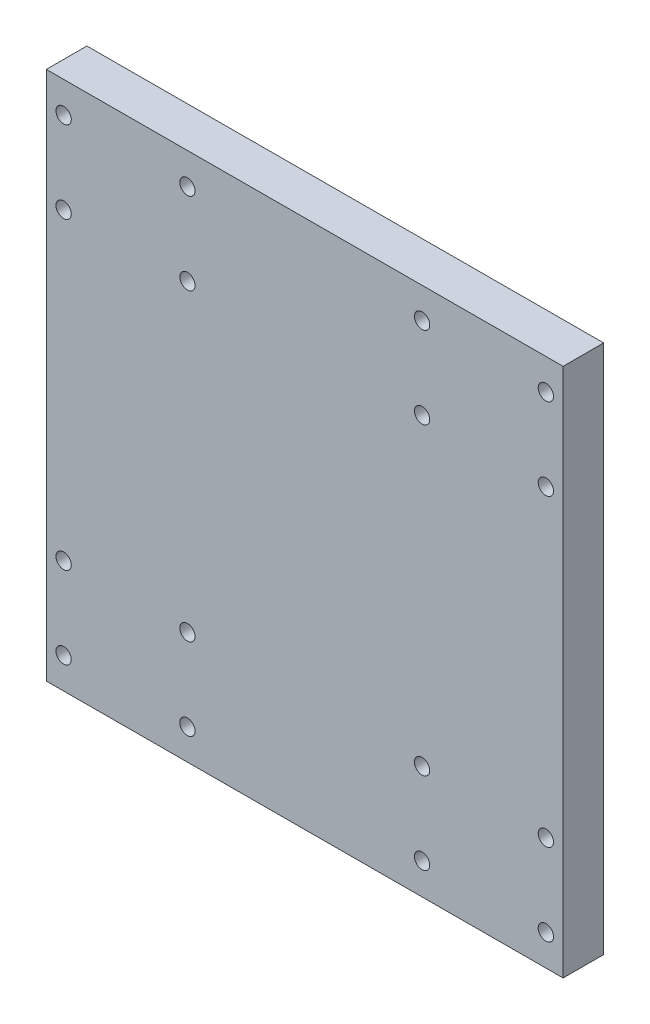
ISO-10303-21;
HEADER;
FILE_DESCRIPTION(('STEP AP214'),'2;1');
FILE_NAME('part.step','',(''),(''),'','','');
FILE_SCHEMA(('AUTOMOTIVE_DESIGN { 1 0 10303 214 1 1 1 1 }'));
ENDSEC;
DATA;
#1=APPLICATION_CONTEXT('core data for automotive mechanical design processes');
#2=APPLICATION_PROTOCOL_DEFINITION('international standard','automotive_design',2000,#1);
#3=PRODUCT_CONTEXT('',#1,'mechanical');
#4=PRODUCT('Part','Part','',(#3));
#5=PRODUCT_RELATED_PRODUCT_CATEGORY('part','',(#4));
#6=PRODUCT_DEFINITION_FORMATION('','',#4);
#7=PRODUCT_DEFINITION_CONTEXT('part definition',#1,'design');
#8=PRODUCT_DEFINITION('design','',#6,#7);
#9=PRODUCT_DEFINITION_SHAPE('','',#8);
#10=(LENGTH_UNIT() NAMED_UNIT(*) SI_UNIT(.MILLI.,.METRE.));
#11=(NAMED_UNIT(*) PLANE_ANGLE_UNIT() SI_UNIT($,.RADIAN.));
#12=(NAMED_UNIT(*) SI_UNIT($,.STERADIAN.) SOLID_ANGLE_UNIT());
#13=UNCERTAINTY_MEASURE_WITH_UNIT(LENGTH_MEASURE(1.E-05),#10,'distance_accuracy_value','');
#14=(GEOMETRIC_REPRESENTATION_CONTEXT(3) GLOBAL_UNCERTAINTY_ASSIGNED_CONTEXT((#13)) GLOBAL_UNIT_ASSIGNED_CONTEXT((#10,
#11,#12)) REPRESENTATION_CONTEXT('',''));
#15=CARTESIAN_POINT('',(0.,0.,0.));
#16=DIRECTION('',(0.,0.,1.));
#17=DIRECTION('',(1.,0.,0.));
#18=AXIS2_PLACEMENT_3D('',#15,#16,#17);
#19=CARTESIAN_POINT('',(0.,0.,5.9944));
#20=DIRECTION('',(0.,0.,1.));
#21=DIRECTION('',(1.,0.,0.));
#22=AXIS2_PLACEMENT_3D('',#19,#20,#21);
#23=PLANE('',#22);
#24=CARTESIAN_POINT('',(-5.44490493665236,63.3650122803423,5.9944));
#25=DIRECTION('',(0.,0.,1.));
#26=DIRECTION('',(1.,0.,0.));
#27=AXIS2_PLACEMENT_3D('',#24,#25,#26);
#28=CIRCLE('',#27,1.13211215);
#29=CARTESIAN_POINT('',(-4.31279278665235,63.3650122803423,5.9944));
#30=VERTEX_POINT('',#29);
#31=EDGE_CURVE('E193',#30,#30,#28,.T.);
#32=ORIENTED_EDGE('',*,*,#31,.F.);
#33=EDGE_LOOP('',(#32));
#34=FACE_BOUND('',#33,.T.);
#35=CARTESIAN_POINT('',(12.8627350633476,51.2496622803423,5.9944));
#36=DIRECTION('',(0.,0.,1.));
#37=DIRECTION('',(1.,0.,0.));
#38=AXIS2_PLACEMENT_3D('',#35,#36,#37);
#39=CIRCLE('',#38,1.13211215);
#40=CARTESIAN_POINT('',(13.9948472133476,51.2496622803423,5.9944));
#41=VERTEX_POINT('',#40);
#42=EDGE_CURVE('E181',#41,#41,#39,.T.);
#43=ORIENTED_EDGE('',*,*,#42,.F.);
#44=EDGE_LOOP('',(#43));
#45=FACE_BOUND('',#44,.T.);
#46=CARTESIAN_POINT('',(65.8819050633449,63.5485804654373,5.9944));
#47=DIRECTION('',(0.,0.,1.));
#48=DIRECTION('',(1.,0.,0.));
#49=AXIS2_PLACEMENT_3D('',#46,#47,#48);
#50=CIRCLE('',#49,1.13211215000001);
#51=CARTESIAN_POINT('',(67.0140172133449,63.5485804654373,5.9944));
#52=VERTEX_POINT('',#51);
#53=EDGE_CURVE('E169',#52,#52,#50,.T.);
#54=ORIENTED_EDGE('',*,*,#53,.F.);
#55=EDGE_LOOP('',(#54));
#56=FACE_BOUND('',#55,.T.);
#57=CARTESIAN_POINT('',(47.5742650633449,51.4332304654373,5.9944));
#58=DIRECTION('',(0.,0.,1.));
#59=DIRECTION('',(1.,0.,0.));
#60=AXIS2_PLACEMENT_3D('',#57,#58,#59);
#61=CIRCLE('',#60,1.13211215);
#62=CARTESIAN_POINT('',(48.7063772133449,51.4332304654373,5.9944));
#63=VERTEX_POINT('',#62);
#64=EDGE_CURVE('E157',#63,#63,#61,.T.);
#65=ORIENTED_EDGE('',*,*,#64,.F.);
#66=EDGE_LOOP('',(#65));
#67=FACE_BOUND('',#66,.T.);
#68=CARTESIAN_POINT('',(65.8819050632628,6.4654104653279,5.9944));
#69=DIRECTION('',(0.,0.,1.));
#70=DIRECTION('',(1.,0.,0.));
#71=AXIS2_PLACEMENT_3D('',#68,#69,#70);
#72=CIRCLE('',#71,1.13211215000001);
#73=CARTESIAN_POINT('',(67.0140172132628,6.4654104653279,5.9944));
#74=VERTEX_POINT('',#73);
#75=EDGE_CURVE('E145',#74,#74,#72,.T.);
#76=ORIENTED_EDGE('',*,*,#75,.F.);
#77=EDGE_LOOP('',(#76));
#78=FACE_BOUND('',#77,.T.);
#79=CARTESIAN_POINT('',(47.5742650632628,-5.64993953467209,5.9944));
#80=DIRECTION('',(0.,0.,1.));
#81=DIRECTION('',(1.,0.,0.));
#82=AXIS2_PLACEMENT_3D('',#79,#80,#81);
#83=CIRCLE('',#82,1.13211215);
#84=CARTESIAN_POINT('',(48.7063772132628,-5.64993953467209,5.9944));
#85=VERTEX_POINT('',#84);
#86=EDGE_CURVE('E133',#85,#85,#83,.T.);
#87=ORIENTED_EDGE('',*,*,#86,.F.);
#88=EDGE_LOOP('',(#87));
#89=FACE_BOUND('',#88,.T.);
#90=CARTESIAN_POINT('',(12.8627350634164,6.28184228041996,5.9944));
#91=DIRECTION('',(0.,0.,1.));
#92=DIRECTION('',(1.,0.,0.));
#93=AXIS2_PLACEMENT_3D('',#90,#91,#92);
#94=CIRCLE('',#93,1.13211215);
#95=CARTESIAN_POINT('',(13.9948472134164,6.28184228041996,5.9944));
#96=VERTEX_POINT('',#95);
#97=EDGE_CURVE('E121',#96,#96,#94,.T.);
#98=ORIENTED_EDGE('',*,*,#97,.F.);
#99=EDGE_LOOP('',(#98));
#100=FACE_BOUND('',#99,.T.);
#101=CARTESIAN_POINT('',(-5.44490493658358,-5.83350771958004,5.9944));
#102=DIRECTION('',(0.,0.,1.));
#103=DIRECTION('',(1.,0.,0.));
#104=AXIS2_PLACEMENT_3D('',#101,#102,#103);
#105=CIRCLE('',#104,1.13211215);
#106=CARTESIAN_POINT('',(-4.31279278658358,-5.83350771958004,5.9944));
#107=VERTEX_POINT('',#106);
#108=EDGE_CURVE('E100',#107,#107,#105,.T.);
#109=ORIENTED_EDGE('',*,*,#108,.F.);
#110=EDGE_LOOP('',(#109));
#111=FACE_BOUND('',#110,.T.);
#112=DIRECTION('',(0.99999694501923,0.00247183175127711,0.));
#113=VECTOR('',#112,1.);
#114=CARTESIAN_POINT('',(-8.00258993658358,-10.41311001958,5.9944));
#115=LINE('',#114,#113);
#116=CARTESIAN_POINT('',(-8.00258993658358,-10.41311001958,5.9944));
#117=VERTEX_POINT('',#116);
#118=CARTESIAN_POINT('',(68.4395900634136,-10.2241572346721,5.9944));
#119=VERTEX_POINT('',#118);
#120=EDGE_CURVE('E85',#117,#119,#115,.T.);
#121=ORIENTED_EDGE('',*,*,#120,.T.);
#122=DIRECTION('',(0.,1.,0.));
#123=VECTOR('',#122,1.);
#124=CARTESIAN_POINT('',(68.4395900634136,-10.2241572346721,5.9944));
#125=LINE('',#124,#123);
#126=CARTESIAN_POINT('',(68.4395900634136,68.1281827654373,5.9944));
#127=VERTEX_POINT('',#126);
#128=EDGE_CURVE('E80',#119,#127,#125,.T.);
#129=ORIENTED_EDGE('',*,*,#128,.T.);
#130=DIRECTION('',(-0.999996945019224,-0.00247183175372369,0.));
#131=VECTOR('',#130,1.);
#132=CARTESIAN_POINT('',(68.4395900634136,68.1281827654373,5.9944));
#133=LINE('',#132,#131);
#134=CARTESIAN_POINT('',(-8.00258993658359,67.9392299803423,5.9944));
#135=VERTEX_POINT('',#134);
#136=EDGE_CURVE('E83',#127,#135,#133,.T.);
#137=ORIENTED_EDGE('',*,*,#136,.T.);
#138=DIRECTION('',(0.,-1.,0.));
#139=VECTOR('',#138,1.);
#140=CARTESIAN_POINT('',(-8.00258993658359,67.9392299803423,5.9944));
#141=LINE('',#140,#139);
#142=EDGE_CURVE('E50',#135,#117,#141,.T.);
#143=ORIENTED_EDGE('',*,*,#142,.T.);
#144=EDGE_LOOP('',(#121,#129,#137,#143));
#145=FACE_BOUND('',#144,.T.);
#146=CARTESIAN_POINT('',(-5.44490493658358,6.28184228041996,5.9944));
#147=DIRECTION('',(0.,0.,1.));
#148=DIRECTION('',(1.,0.,0.));
#149=AXIS2_PLACEMENT_3D('',#146,#147,#148);
#150=CIRCLE('',#149,1.13211215);
#151=CARTESIAN_POINT('',(-4.31279278658358,6.28184228041996,5.9944));
#152=VERTEX_POINT('',#151);
#153=EDGE_CURVE('E115',#152,#152,#150,.T.);
#154=ORIENTED_EDGE('',*,*,#153,.F.);
#155=EDGE_LOOP('',(#154));
#156=FACE_BOUND('',#155,.T.);
#157=CARTESIAN_POINT('',(12.8627350634164,-5.83350771958004,5.9944));
#158=DIRECTION('',(0.,0.,1.));
#159=DIRECTION('',(1.,0.,0.));
#160=AXIS2_PLACEMENT_3D('',#157,#158,#159);
#161=CIRCLE('',#160,1.13211215);
#162=CARTESIAN_POINT('',(13.9948472134164,-5.83350771958004,5.9944));
#163=VERTEX_POINT('',#162);
#164=EDGE_CURVE('E127',#163,#163,#161,.T.);
#165=ORIENTED_EDGE('',*,*,#164,.F.);
#166=EDGE_LOOP('',(#165));
#167=FACE_BOUND('',#166,.T.);
#168=CARTESIAN_POINT('',(47.5742650632628,6.46541046532791,5.9944));
#169=DIRECTION('',(0.,0.,1.));
#170=DIRECTION('',(1.,0.,0.));
#171=AXIS2_PLACEMENT_3D('',#168,#169,#170);
#172=CIRCLE('',#171,1.13211215000001);
#173=CARTESIAN_POINT('',(48.7063772132628,6.46541046532791,5.9944));
#174=VERTEX_POINT('',#173);
#175=EDGE_CURVE('E139',#174,#174,#172,.T.);
#176=ORIENTED_EDGE('',*,*,#175,.F.);
#177=EDGE_LOOP('',(#176));
#178=FACE_BOUND('',#177,.T.);
#179=CARTESIAN_POINT('',(65.8819050632628,-5.64993953467209,5.9944));
#180=DIRECTION('',(0.,0.,1.));
#181=DIRECTION('',(1.,0.,0.));
#182=AXIS2_PLACEMENT_3D('',#179,#180,#181);
#183=CIRCLE('',#182,1.13211215000001);
#184=CARTESIAN_POINT('',(67.0140172132628,-5.64993953467209,5.9944));
#185=VERTEX_POINT('',#184);
#186=EDGE_CURVE('E151',#185,#185,#183,.T.);
#187=ORIENTED_EDGE('',*,*,#186,.F.);
#188=EDGE_LOOP('',(#187));
#189=FACE_BOUND('',#188,.T.);
#190=CARTESIAN_POINT('',(47.5742650633449,63.5485804654373,5.9944));
#191=DIRECTION('',(0.,0.,1.));
#192=DIRECTION('',(1.,0.,0.));
#193=AXIS2_PLACEMENT_3D('',#190,#191,#192);
#194=CIRCLE('',#193,1.13211215);
#195=CARTESIAN_POINT('',(48.7063772133449,63.5485804654373,5.9944));
#196=VERTEX_POINT('',#195);
#197=EDGE_CURVE('E163',#196,#196,#194,.T.);
#198=ORIENTED_EDGE('',*,*,#197,.F.);
#199=EDGE_LOOP('',(#198));
#200=FACE_BOUND('',#199,.T.);
#201=CARTESIAN_POINT('',(65.8819050633449,51.4332304654373,5.9944));
#202=DIRECTION('',(0.,0.,1.));
#203=DIRECTION('',(1.,0.,0.));
#204=AXIS2_PLACEMENT_3D('',#201,#202,#203);
#205=CIRCLE('',#204,1.13211214999999);
#206=CARTESIAN_POINT('',(67.0140172133449,51.4332304654373,5.9944));
#207=VERTEX_POINT('',#206);
#208=EDGE_CURVE('E175',#207,#207,#205,.T.);
#209=ORIENTED_EDGE('',*,*,#208,.F.);
#210=EDGE_LOOP('',(#209));
#211=FACE_BOUND('',#210,.T.);
#212=CARTESIAN_POINT('',(12.8627350633476,63.3650122803423,5.9944));
#213=DIRECTION('',(0.,0.,1.));
#214=DIRECTION('',(1.,0.,0.));
#215=AXIS2_PLACEMENT_3D('',#212,#213,#214);
#216=CIRCLE('',#215,1.13211215);
#217=CARTESIAN_POINT('',(13.9948472133477,63.3650122803423,5.9944));
#218=VERTEX_POINT('',#217);
#219=EDGE_CURVE('E187',#218,#218,#216,.T.);
#220=ORIENTED_EDGE('',*,*,#219,.F.);
#221=EDGE_LOOP('',(#220));
#222=FACE_BOUND('',#221,.T.);
#223=CARTESIAN_POINT('',(-5.44490493665236,51.2496622803423,5.9944));
#224=DIRECTION('',(0.,0.,1.));
#225=DIRECTION('',(1.,0.,0.));
#226=AXIS2_PLACEMENT_3D('',#223,#224,#225);
#227=CIRCLE('',#226,1.13211215);
#228=CARTESIAN_POINT('',(-4.31279278665235,51.2496622803423,5.9944));
#229=VERTEX_POINT('',#228);
#230=EDGE_CURVE('E199',#229,#229,#227,.T.);
#231=ORIENTED_EDGE('',*,*,#230,.F.);
#232=EDGE_LOOP('',(#231));
#233=FACE_BOUND('',#232,.T.);
#234=ADVANCED_FACE('F33',(#34,#45,#56,#67,#78,#89,#100,#111,#145,#156,#167,#178,#189,#200,#211,
#222,#233),#23,.T.);
#235=CARTESIAN_POINT('',(0.,0.,0.));
#236=DIRECTION('',(0.,0.,1.));
#237=DIRECTION('',(1.,0.,0.));
#238=AXIS2_PLACEMENT_3D('',#235,#236,#237);
#239=PLANE('',#238);
#240=DIRECTION('',(0.99999694501923,0.00247183175127711,0.));
#241=VECTOR('',#240,1.);
#242=CARTESIAN_POINT('',(-8.00258993658358,-10.41311001958,0.));
#243=LINE('',#242,#241);
#244=CARTESIAN_POINT('',(-8.00258993658358,-10.41311001958,0.));
#245=VERTEX_POINT('',#244);
#246=CARTESIAN_POINT('',(68.4395900634136,-10.2241572346721,0.));
#247=VERTEX_POINT('',#246);
#248=EDGE_CURVE('E97',#245,#247,#243,.T.);
#249=ORIENTED_EDGE('',*,*,#248,.F.);
#250=DIRECTION('',(0.,-1.,0.));
#251=VECTOR('',#250,1.);
#252=CARTESIAN_POINT('',(-8.00258993658359,67.9392299803423,0.));
#253=LINE('',#252,#251);
#254=CARTESIAN_POINT('',(-8.00258993658359,67.9392299803423,0.));
#255=VERTEX_POINT('',#254);
#256=EDGE_CURVE('E73',#255,#245,#253,.T.);
#257=ORIENTED_EDGE('',*,*,#256,.F.);
#258=DIRECTION('',(-0.999996945019224,-0.00247183175372369,0.));
#259=VECTOR('',#258,1.);
#260=CARTESIAN_POINT('',(68.4395900634136,68.1281827654373,0.));
#261=LINE('',#260,#259);
#262=CARTESIAN_POINT('',(68.4395900634136,68.1281827654373,0.));
#263=VERTEX_POINT('',#262);
#264=EDGE_CURVE('E67',#263,#255,#261,.T.);
#265=ORIENTED_EDGE('',*,*,#264,.F.);
#266=DIRECTION('',(0.,1.,0.));
#267=VECTOR('',#266,1.);
#268=CARTESIAN_POINT('',(68.4395900634136,-10.2241572346721,0.));
#269=LINE('',#268,#267);
#270=EDGE_CURVE('E89',#247,#263,#269,.T.);
#271=ORIENTED_EDGE('',*,*,#270,.F.);
#272=EDGE_LOOP('',(#249,#257,#265,#271));
#273=FACE_BOUND('',#272,.T.);
#274=CARTESIAN_POINT('',(-5.44490493658358,-5.83350771958004,0.));
#275=DIRECTION('',(0.,0.,1.));
#276=DIRECTION('',(1.,0.,0.));
#277=AXIS2_PLACEMENT_3D('',#274,#275,#276);
#278=CIRCLE('',#277,1.13211215);
#279=CARTESIAN_POINT('',(-4.31279278658358,-5.83350771958004,0.));
#280=VERTEX_POINT('',#279);
#281=EDGE_CURVE('E112',#280,#280,#278,.T.);
#282=ORIENTED_EDGE('',*,*,#281,.T.);
#283=EDGE_LOOP('',(#282));
#284=FACE_BOUND('',#283,.T.);
#285=CARTESIAN_POINT('',(-5.44490493658358,6.28184228041996,0.));
#286=DIRECTION('',(0.,0.,1.));
#287=DIRECTION('',(1.,0.,0.));
#288=AXIS2_PLACEMENT_3D('',#285,#286,#287);
#289=CIRCLE('',#288,1.13211215);
#290=CARTESIAN_POINT('',(-4.31279278658358,6.28184228041996,0.));
#291=VERTEX_POINT('',#290);
#292=EDGE_CURVE('E118',#291,#291,#289,.T.);
#293=ORIENTED_EDGE('',*,*,#292,.T.);
#294=EDGE_LOOP('',(#293));
#295=FACE_BOUND('',#294,.T.);
#296=CARTESIAN_POINT('',(12.8627350634164,6.28184228041996,0.));
#297=DIRECTION('',(0.,0.,1.));
#298=DIRECTION('',(1.,0.,0.));
#299=AXIS2_PLACEMENT_3D('',#296,#297,#298);
#300=CIRCLE('',#299,1.13211215);
#301=CARTESIAN_POINT('',(13.9948472134164,6.28184228041996,0.));
#302=VERTEX_POINT('',#301);
#303=EDGE_CURVE('E124',#302,#302,#300,.T.);
#304=ORIENTED_EDGE('',*,*,#303,.T.);
#305=EDGE_LOOP('',(#304));
#306=FACE_BOUND('',#305,.T.);
#307=CARTESIAN_POINT('',(12.8627350634164,-5.83350771958004,0.));
#308=DIRECTION('',(0.,0.,1.));
#309=DIRECTION('',(1.,0.,0.));
#310=AXIS2_PLACEMENT_3D('',#307,#308,#309);
#311=CIRCLE('',#310,1.13211215);
#312=CARTESIAN_POINT('',(13.9948472134164,-5.83350771958004,0.));
#313=VERTEX_POINT('',#312);
#314=EDGE_CURVE('E130',#313,#313,#311,.T.);
#315=ORIENTED_EDGE('',*,*,#314,.T.);
#316=EDGE_LOOP('',(#315));
#317=FACE_BOUND('',#316,.T.);
#318=CARTESIAN_POINT('',(47.5742650632628,-5.64993953467209,0.));
#319=DIRECTION('',(0.,0.,1.));
#320=DIRECTION('',(1.,0.,0.));
#321=AXIS2_PLACEMENT_3D('',#318,#319,#320);
#322=CIRCLE('',#321,1.13211215);
#323=CARTESIAN_POINT('',(48.7063772132628,-5.64993953467209,0.));
#324=VERTEX_POINT('',#323);
#325=EDGE_CURVE('E136',#324,#324,#322,.T.);
#326=ORIENTED_EDGE('',*,*,#325,.T.);
#327=EDGE_LOOP('',(#326));
#328=FACE_BOUND('',#327,.T.);
#329=CARTESIAN_POINT('',(47.5742650632628,6.46541046532791,0.));
#330=DIRECTION('',(0.,0.,1.));
#331=DIRECTION('',(1.,0.,0.));
#332=AXIS2_PLACEMENT_3D('',#329,#330,#331);
#333=CIRCLE('',#332,1.13211215000001);
#334=CARTESIAN_POINT('',(48.7063772132628,6.46541046532791,0.));
#335=VERTEX_POINT('',#334);
#336=EDGE_CURVE('E142',#335,#335,#333,.T.);
#337=ORIENTED_EDGE('',*,*,#336,.T.);
#338=EDGE_LOOP('',(#337));
#339=FACE_BOUND('',#338,.T.);
#340=CARTESIAN_POINT('',(65.8819050632628,6.4654104653279,0.));
#341=DIRECTION('',(0.,0.,1.));
#342=DIRECTION('',(1.,0.,0.));
#343=AXIS2_PLACEMENT_3D('',#340,#341,#342);
#344=CIRCLE('',#343,1.13211215000001);
#345=CARTESIAN_POINT('',(67.0140172132628,6.4654104653279,0.));
#346=VERTEX_POINT('',#345);
#347=EDGE_CURVE('E148',#346,#346,#344,.T.);
#348=ORIENTED_EDGE('',*,*,#347,.T.);
#349=EDGE_LOOP('',(#348));
#350=FACE_BOUND('',#349,.T.);
#351=CARTESIAN_POINT('',(65.8819050632628,-5.64993953467209,0.));
#352=DIRECTION('',(0.,0.,1.));
#353=DIRECTION('',(1.,0.,0.));
#354=AXIS2_PLACEMENT_3D('',#351,#352,#353);
#355=CIRCLE('',#354,1.13211215000001);
#356=CARTESIAN_POINT('',(67.0140172132628,-5.64993953467209,0.));
#357=VERTEX_POINT('',#356);
#358=EDGE_CURVE('E154',#357,#357,#355,.T.);
#359=ORIENTED_EDGE('',*,*,#358,.T.);
#360=EDGE_LOOP('',(#359));
#361=FACE_BOUND('',#360,.T.);
#362=CARTESIAN_POINT('',(47.5742650633449,51.4332304654373,0.));
#363=DIRECTION('',(0.,0.,1.));
#364=DIRECTION('',(1.,0.,0.));
#365=AXIS2_PLACEMENT_3D('',#362,#363,#364);
#366=CIRCLE('',#365,1.13211215);
#367=CARTESIAN_POINT('',(48.7063772133449,51.4332304654373,0.));
#368=VERTEX_POINT('',#367);
#369=EDGE_CURVE('E160',#368,#368,#366,.T.);
#370=ORIENTED_EDGE('',*,*,#369,.T.);
#371=EDGE_LOOP('',(#370));
#372=FACE_BOUND('',#371,.T.);
#373=CARTESIAN_POINT('',(47.5742650633449,63.5485804654373,0.));
#374=DIRECTION('',(0.,0.,1.));
#375=DIRECTION('',(1.,0.,0.));
#376=AXIS2_PLACEMENT_3D('',#373,#374,#375);
#377=CIRCLE('',#376,1.13211215);
#378=CARTESIAN_POINT('',(48.7063772133449,63.5485804654373,0.));
#379=VERTEX_POINT('',#378);
#380=EDGE_CURVE('E166',#379,#379,#377,.T.);
#381=ORIENTED_EDGE('',*,*,#380,.T.);
#382=EDGE_LOOP('',(#381));
#383=FACE_BOUND('',#382,.T.);
#384=CARTESIAN_POINT('',(65.8819050633449,63.5485804654373,0.));
#385=DIRECTION('',(0.,0.,1.));
#386=DIRECTION('',(1.,0.,0.));
#387=AXIS2_PLACEMENT_3D('',#384,#385,#386);
#388=CIRCLE('',#387,1.13211215000001);
#389=CARTESIAN_POINT('',(67.0140172133449,63.5485804654373,0.));
#390=VERTEX_POINT('',#389);
#391=EDGE_CURVE('E172',#390,#390,#388,.T.);
#392=ORIENTED_EDGE('',*,*,#391,.T.);
#393=EDGE_LOOP('',(#392));
#394=FACE_BOUND('',#393,.T.);
#395=CARTESIAN_POINT('',(65.8819050633449,51.4332304654373,0.));
#396=DIRECTION('',(0.,0.,1.));
#397=DIRECTION('',(1.,0.,0.));
#398=AXIS2_PLACEMENT_3D('',#395,#396,#397);
#399=CIRCLE('',#398,1.13211214999999);
#400=CARTESIAN_POINT('',(67.0140172133449,51.4332304654373,0.));
#401=VERTEX_POINT('',#400);
#402=EDGE_CURVE('E178',#401,#401,#399,.T.);
#403=ORIENTED_EDGE('',*,*,#402,.T.);
#404=EDGE_LOOP('',(#403));
#405=FACE_BOUND('',#404,.T.);
#406=CARTESIAN_POINT('',(12.8627350633476,51.2496622803423,0.));
#407=DIRECTION('',(0.,0.,1.));
#408=DIRECTION('',(1.,0.,0.));
#409=AXIS2_PLACEMENT_3D('',#406,#407,#408);
#410=CIRCLE('',#409,1.13211215);
#411=CARTESIAN_POINT('',(13.9948472133476,51.2496622803423,0.));
#412=VERTEX_POINT('',#411);
#413=EDGE_CURVE('E184',#412,#412,#410,.T.);
#414=ORIENTED_EDGE('',*,*,#413,.T.);
#415=EDGE_LOOP('',(#414));
#416=FACE_BOUND('',#415,.T.);
#417=CARTESIAN_POINT('',(12.8627350633476,63.3650122803423,0.));
#418=DIRECTION('',(0.,0.,1.));
#419=DIRECTION('',(1.,0.,0.));
#420=AXIS2_PLACEMENT_3D('',#417,#418,#419);
#421=CIRCLE('',#420,1.13211215);
#422=CARTESIAN_POINT('',(13.9948472133477,63.3650122803423,0.));
#423=VERTEX_POINT('',#422);
#424=EDGE_CURVE('E190',#423,#423,#421,.T.);
#425=ORIENTED_EDGE('',*,*,#424,.T.);
#426=EDGE_LOOP('',(#425));
#427=FACE_BOUND('',#426,.T.);
#428=CARTESIAN_POINT('',(-5.44490493665236,63.3650122803423,0.));
#429=DIRECTION('',(0.,0.,1.));
#430=DIRECTION('',(1.,0.,0.));
#431=AXIS2_PLACEMENT_3D('',#428,#429,#430);
#432=CIRCLE('',#431,1.13211215);
#433=CARTESIAN_POINT('',(-4.31279278665235,63.3650122803423,0.));
#434=VERTEX_POINT('',#433);
#435=EDGE_CURVE('E196',#434,#434,#432,.T.);
#436=ORIENTED_EDGE('',*,*,#435,.T.);
#437=EDGE_LOOP('',(#436));
#438=FACE_BOUND('',#437,.T.);
#439=CARTESIAN_POINT('',(-5.44490493665236,51.2496622803423,0.));
#440=DIRECTION('',(0.,0.,1.));
#441=DIRECTION('',(1.,0.,0.));
#442=AXIS2_PLACEMENT_3D('',#439,#440,#441);
#443=CIRCLE('',#442,1.13211215);
#444=CARTESIAN_POINT('',(-4.31279278665235,51.2496622803423,0.));
#445=VERTEX_POINT('',#444);
#446=EDGE_CURVE('E202',#445,#445,#443,.T.);
#447=ORIENTED_EDGE('',*,*,#446,.T.);
#448=EDGE_LOOP('',(#447));
#449=FACE_BOUND('',#448,.T.);
#450=ADVANCED_FACE('F108',(#273,#284,#295,#306,#317,#328,#339,#350,#361,#372,#383,#394,#405,
#416,#427,#438,#449),#239,.F.);
#451=CARTESIAN_POINT('',(-8.00258993658358,-10.41311001958,5.9944));
#452=DIRECTION('',(-0.00247183175127711,0.99999694501923,0.));
#453=DIRECTION('',(-0.99999694501923,-0.00247183175127711,0.));
#454=AXIS2_PLACEMENT_3D('',#451,#452,#453);
#455=PLANE('',#454);
#456=ORIENTED_EDGE('',*,*,#248,.T.);
#457=DIRECTION('',(0.,0.,-1.));
#458=VECTOR('',#457,1.);
#459=CARTESIAN_POINT('',(68.4395900634136,-10.2241572346721,5.9944));
#460=LINE('',#459,#458);
#461=EDGE_CURVE('E11',#119,#247,#460,.T.);
#462=ORIENTED_EDGE('',*,*,#461,.F.);
#463=ORIENTED_EDGE('',*,*,#120,.F.);
#464=DIRECTION('',(0.,0.,-1.));
#465=VECTOR('',#464,1.);
#466=CARTESIAN_POINT('',(-8.00258993658358,-10.41311001958,5.9944));
#467=LINE('',#466,#465);
#468=EDGE_CURVE('E93',#117,#245,#467,.T.);
#469=ORIENTED_EDGE('',*,*,#468,.T.);
#470=EDGE_LOOP('',(#456,#462,#463,#469));
#471=FACE_BOUND('',#470,.T.);
#472=ADVANCED_FACE('F35',(#471),#455,.F.);
#473=CARTESIAN_POINT('',(68.4395900634136,-10.2241572346721,5.9944));
#474=DIRECTION('',(-1.,0.,0.));
#475=DIRECTION('',(0.,0.,1.));
#476=AXIS2_PLACEMENT_3D('',#473,#474,#475);
#477=PLANE('',#476);
#478=ORIENTED_EDGE('',*,*,#270,.T.);
#479=DIRECTION('',(0.,0.,-1.));
#480=VECTOR('',#479,1.);
#481=CARTESIAN_POINT('',(68.4395900634136,68.1281827654373,5.9944));
#482=LINE('',#481,#480);
#483=EDGE_CURVE('E42',#127,#263,#482,.T.);
#484=ORIENTED_EDGE('',*,*,#483,.F.);
#485=ORIENTED_EDGE('',*,*,#128,.F.);
#486=ORIENTED_EDGE('',*,*,#461,.T.);
#487=EDGE_LOOP('',(#478,#484,#485,#486));
#488=FACE_BOUND('',#487,.T.);
#489=ADVANCED_FACE('F88',(#488),#477,.F.);
#490=CARTESIAN_POINT('',(68.4395900634136,68.1281827654373,5.9944));
#491=DIRECTION('',(0.00247183175372369,-0.999996945019224,0.));
#492=DIRECTION('',(0.999996945019224,0.00247183175372369,0.));
#493=AXIS2_PLACEMENT_3D('',#490,#491,#492);
#494=PLANE('',#493);
#495=ORIENTED_EDGE('',*,*,#264,.T.);
#496=DIRECTION('',(0.,0.,-1.));
#497=VECTOR('',#496,1.);
#498=CARTESIAN_POINT('',(-8.00258993658359,67.9392299803423,5.9944));
#499=LINE('',#498,#497);
#500=EDGE_CURVE('E90',#135,#255,#499,.T.);
#501=ORIENTED_EDGE('',*,*,#500,.F.);
#502=ORIENTED_EDGE('',*,*,#136,.F.);
#503=ORIENTED_EDGE('',*,*,#483,.T.);
#504=EDGE_LOOP('',(#495,#501,#502,#503));
#505=FACE_BOUND('',#504,.T.);
#506=ADVANCED_FACE('F91',(#505),#494,.F.);
#507=CARTESIAN_POINT('',(-8.00258993658359,67.9392299803423,5.9944));
#508=DIRECTION('',(1.,0.,0.));
#509=DIRECTION('',(0.,1.,0.));
#510=AXIS2_PLACEMENT_3D('',#507,#508,#509);
#511=PLANE('',#510);
#512=ORIENTED_EDGE('',*,*,#256,.T.);
#513=ORIENTED_EDGE('',*,*,#468,.F.);
#514=ORIENTED_EDGE('',*,*,#142,.F.);
#515=ORIENTED_EDGE('',*,*,#500,.T.);
#516=EDGE_LOOP('',(#512,#513,#514,#515));
#517=FACE_BOUND('',#516,.T.);
#518=ADVANCED_FACE('F105',(#517),#511,.F.);
#519=CARTESIAN_POINT('',(-5.44490493658358,-5.83350771958004,5.9944));
#520=DIRECTION('',(0.,0.,-1.));
#521=DIRECTION('',(-1.,0.,0.));
#522=AXIS2_PLACEMENT_3D('',#519,#520,#521);
#523=CYLINDRICAL_SURFACE('',#522,1.13211215);
#524=ORIENTED_EDGE('',*,*,#108,.T.);
#525=EDGE_LOOP('',(#524));
#526=FACE_BOUND('',#525,.T.);
#527=ORIENTED_EDGE('',*,*,#281,.F.);
#528=EDGE_LOOP('',(#527));
#529=FACE_BOUND('',#528,.T.);
#530=ADVANCED_FACE('F221',(#526,#529),#523,.F.);
#531=CARTESIAN_POINT('',(-5.44490493658358,6.28184228041996,5.9944));
#532=DIRECTION('',(0.,0.,-1.));
#533=DIRECTION('',(-1.,0.,0.));
#534=AXIS2_PLACEMENT_3D('',#531,#532,#533);
#535=CYLINDRICAL_SURFACE('',#534,1.13211215);
#536=ORIENTED_EDGE('',*,*,#153,.T.);
#537=EDGE_LOOP('',(#536));
#538=FACE_BOUND('',#537,.T.);
#539=ORIENTED_EDGE('',*,*,#292,.F.);
#540=EDGE_LOOP('',(#539));
#541=FACE_BOUND('',#540,.T.);
#542=ADVANCED_FACE('F267',(#538,#541),#535,.F.);
#543=CARTESIAN_POINT('',(12.8627350634164,6.28184228041996,5.9944));
#544=DIRECTION('',(0.,0.,-1.));
#545=DIRECTION('',(-1.,0.,0.));
#546=AXIS2_PLACEMENT_3D('',#543,#544,#545);
#547=CYLINDRICAL_SURFACE('',#546,1.13211215);
#548=ORIENTED_EDGE('',*,*,#97,.T.);
#549=EDGE_LOOP('',(#548));
#550=FACE_BOUND('',#549,.T.);
#551=ORIENTED_EDGE('',*,*,#303,.F.);
#552=EDGE_LOOP('',(#551));
#553=FACE_BOUND('',#552,.T.);
#554=ADVANCED_FACE('F275',(#550,#553),#547,.F.);
#555=CARTESIAN_POINT('',(12.8627350634164,-5.83350771958004,5.9944));
#556=DIRECTION('',(0.,0.,-1.));
#557=DIRECTION('',(-1.,0.,0.));
#558=AXIS2_PLACEMENT_3D('',#555,#556,#557);
#559=CYLINDRICAL_SURFACE('',#558,1.13211215);
#560=ORIENTED_EDGE('',*,*,#164,.T.);
#561=EDGE_LOOP('',(#560));
#562=FACE_BOUND('',#561,.T.);
#563=ORIENTED_EDGE('',*,*,#314,.F.);
#564=EDGE_LOOP('',(#563));
#565=FACE_BOUND('',#564,.T.);
#566=ADVANCED_FACE('F283',(#562,#565),#559,.F.);
#567=CARTESIAN_POINT('',(47.5742650632628,-5.64993953467209,5.9944));
#568=DIRECTION('',(0.,0.,-1.));
#569=DIRECTION('',(-1.,0.,0.));
#570=AXIS2_PLACEMENT_3D('',#567,#568,#569);
#571=CYLINDRICAL_SURFACE('',#570,1.13211215);
#572=ORIENTED_EDGE('',*,*,#86,.T.);
#573=EDGE_LOOP('',(#572));
#574=FACE_BOUND('',#573,.T.);
#575=ORIENTED_EDGE('',*,*,#325,.F.);
#576=EDGE_LOOP('',(#575));
#577=FACE_BOUND('',#576,.T.);
#578=ADVANCED_FACE('F292',(#574,#577),#571,.F.);
#579=CARTESIAN_POINT('',(47.5742650632628,6.46541046532791,5.9944));
#580=DIRECTION('',(0.,0.,-1.));
#581=DIRECTION('',(-1.,0.,0.));
#582=AXIS2_PLACEMENT_3D('',#579,#580,#581);
#583=CYLINDRICAL_SURFACE('',#582,1.13211215000001);
#584=ORIENTED_EDGE('',*,*,#175,.T.);
#585=EDGE_LOOP('',(#584));
#586=FACE_BOUND('',#585,.T.);
#587=ORIENTED_EDGE('',*,*,#336,.F.);
#588=EDGE_LOOP('',(#587));
#589=FACE_BOUND('',#588,.T.);
#590=ADVANCED_FACE('F301',(#586,#589),#583,.F.);
#591=CARTESIAN_POINT('',(65.8819050632628,6.4654104653279,5.9944));
#592=DIRECTION('',(0.,0.,-1.));
#593=DIRECTION('',(-1.,0.,0.));
#594=AXIS2_PLACEMENT_3D('',#591,#592,#593);
#595=CYLINDRICAL_SURFACE('',#594,1.13211215000001);
#596=ORIENTED_EDGE('',*,*,#75,.T.);
#597=EDGE_LOOP('',(#596));
#598=FACE_BOUND('',#597,.T.);
#599=ORIENTED_EDGE('',*,*,#347,.F.);
#600=EDGE_LOOP('',(#599));
#601=FACE_BOUND('',#600,.T.);
#602=ADVANCED_FACE('F310',(#598,#601),#595,.F.);
#603=CARTESIAN_POINT('',(65.8819050632628,-5.64993953467209,5.9944));
#604=DIRECTION('',(0.,0.,-1.));
#605=DIRECTION('',(-1.,0.,0.));
#606=AXIS2_PLACEMENT_3D('',#603,#604,#605);
#607=CYLINDRICAL_SURFACE('',#606,1.13211215000001);
#608=ORIENTED_EDGE('',*,*,#186,.T.);
#609=EDGE_LOOP('',(#608));
#610=FACE_BOUND('',#609,.T.);
#611=ORIENTED_EDGE('',*,*,#358,.F.);
#612=EDGE_LOOP('',(#611));
#613=FACE_BOUND('',#612,.T.);
#614=ADVANCED_FACE('F319',(#610,#613),#607,.F.);
#615=CARTESIAN_POINT('',(47.5742650633449,51.4332304654373,5.9944));
#616=DIRECTION('',(0.,0.,-1.));
#617=DIRECTION('',(-1.,0.,0.));
#618=AXIS2_PLACEMENT_3D('',#615,#616,#617);
#619=CYLINDRICAL_SURFACE('',#618,1.13211215);
#620=ORIENTED_EDGE('',*,*,#64,.T.);
#621=EDGE_LOOP('',(#620));
#622=FACE_BOUND('',#621,.T.);
#623=ORIENTED_EDGE('',*,*,#369,.F.);
#624=EDGE_LOOP('',(#623));
#625=FACE_BOUND('',#624,.T.);
#626=ADVANCED_FACE('F328',(#622,#625),#619,.F.);
#627=CARTESIAN_POINT('',(47.5742650633449,63.5485804654373,5.9944));
#628=DIRECTION('',(0.,0.,-1.));
#629=DIRECTION('',(-1.,0.,0.));
#630=AXIS2_PLACEMENT_3D('',#627,#628,#629);
#631=CYLINDRICAL_SURFACE('',#630,1.13211215);
#632=ORIENTED_EDGE('',*,*,#197,.T.);
#633=EDGE_LOOP('',(#632));
#634=FACE_BOUND('',#633,.T.);
#635=ORIENTED_EDGE('',*,*,#380,.F.);
#636=EDGE_LOOP('',(#635));
#637=FACE_BOUND('',#636,.T.);
#638=ADVANCED_FACE('F337',(#634,#637),#631,.F.);
#639=CARTESIAN_POINT('',(65.8819050633449,63.5485804654373,5.9944));
#640=DIRECTION('',(0.,0.,-1.));
#641=DIRECTION('',(-1.,0.,0.));
#642=AXIS2_PLACEMENT_3D('',#639,#640,#641);
#643=CYLINDRICAL_SURFACE('',#642,1.13211215000001);
#644=ORIENTED_EDGE('',*,*,#53,.T.);
#645=EDGE_LOOP('',(#644));
#646=FACE_BOUND('',#645,.T.);
#647=ORIENTED_EDGE('',*,*,#391,.F.);
#648=EDGE_LOOP('',(#647));
#649=FACE_BOUND('',#648,.T.);
#650=ADVANCED_FACE('F346',(#646,#649),#643,.F.);
#651=CARTESIAN_POINT('',(65.8819050633449,51.4332304654373,5.9944));
#652=DIRECTION('',(0.,0.,-1.));
#653=DIRECTION('',(-1.,0.,0.));
#654=AXIS2_PLACEMENT_3D('',#651,#652,#653);
#655=CYLINDRICAL_SURFACE('',#654,1.13211214999999);
#656=ORIENTED_EDGE('',*,*,#208,.T.);
#657=EDGE_LOOP('',(#656));
#658=FACE_BOUND('',#657,.T.);
#659=ORIENTED_EDGE('',*,*,#402,.F.);
#660=EDGE_LOOP('',(#659));
#661=FACE_BOUND('',#660,.T.);
#662=ADVANCED_FACE('F355',(#658,#661),#655,.F.);
#663=CARTESIAN_POINT('',(12.8627350633476,51.2496622803423,5.9944));
#664=DIRECTION('',(0.,0.,-1.));
#665=DIRECTION('',(-1.,0.,0.));
#666=AXIS2_PLACEMENT_3D('',#663,#664,#665);
#667=CYLINDRICAL_SURFACE('',#666,1.13211215);
#668=ORIENTED_EDGE('',*,*,#42,.T.);
#669=EDGE_LOOP('',(#668));
#670=FACE_BOUND('',#669,.T.);
#671=ORIENTED_EDGE('',*,*,#413,.F.);
#672=EDGE_LOOP('',(#671));
#673=FACE_BOUND('',#672,.T.);
#674=ADVANCED_FACE('F364',(#670,#673),#667,.F.);
#675=CARTESIAN_POINT('',(12.8627350633476,63.3650122803423,5.9944));
#676=DIRECTION('',(0.,0.,-1.));
#677=DIRECTION('',(-1.,0.,0.));
#678=AXIS2_PLACEMENT_3D('',#675,#676,#677);
#679=CYLINDRICAL_SURFACE('',#678,1.13211215);
#680=ORIENTED_EDGE('',*,*,#219,.T.);
#681=EDGE_LOOP('',(#680));
#682=FACE_BOUND('',#681,.T.);
#683=ORIENTED_EDGE('',*,*,#424,.F.);
#684=EDGE_LOOP('',(#683));
#685=FACE_BOUND('',#684,.T.);
#686=ADVANCED_FACE('F373',(#682,#685),#679,.F.);
#687=CARTESIAN_POINT('',(-5.44490493665236,63.3650122803423,5.9944));
#688=DIRECTION('',(0.,0.,-1.));
#689=DIRECTION('',(-1.,0.,0.));
#690=AXIS2_PLACEMENT_3D('',#687,#688,#689);
#691=CYLINDRICAL_SURFACE('',#690,1.13211215);
#692=ORIENTED_EDGE('',*,*,#31,.T.);
#693=EDGE_LOOP('',(#692));
#694=FACE_BOUND('',#693,.T.);
#695=ORIENTED_EDGE('',*,*,#435,.F.);
#696=EDGE_LOOP('',(#695));
#697=FACE_BOUND('',#696,.T.);
#698=ADVANCED_FACE('F382',(#694,#697),#691,.F.);
#699=CARTESIAN_POINT('',(-5.44490493665236,51.2496622803423,5.9944));
#700=DIRECTION('',(0.,0.,-1.));
#701=DIRECTION('',(-1.,0.,0.));
#702=AXIS2_PLACEMENT_3D('',#699,#700,#701);
#703=CYLINDRICAL_SURFACE('',#702,1.13211215);
#704=ORIENTED_EDGE('',*,*,#230,.T.);
#705=EDGE_LOOP('',(#704));
#706=FACE_BOUND('',#705,.T.);
#707=ORIENTED_EDGE('',*,*,#446,.F.);
#708=EDGE_LOOP('',(#707));
#709=FACE_BOUND('',#708,.T.);
#710=ADVANCED_FACE('F208',(#706,#709),#703,.F.);
#711=CLOSED_SHELL('',(#234,#450,#472,#489,#506,#518,#530,#542,#554,#566,#578,#590,#602,#614,
#626,#638,#650,#662,#674,#686,#698,#710));
#712=MANIFOLD_SOLID_BREP('B2',#711);
#713=ADVANCED_BREP_SHAPE_REPRESENTATION('',(#18,#712),#14);
#714=SHAPE_DEFINITION_REPRESENTATION(#9,#713);
ENDSEC;
END-ISO-10303-21;
